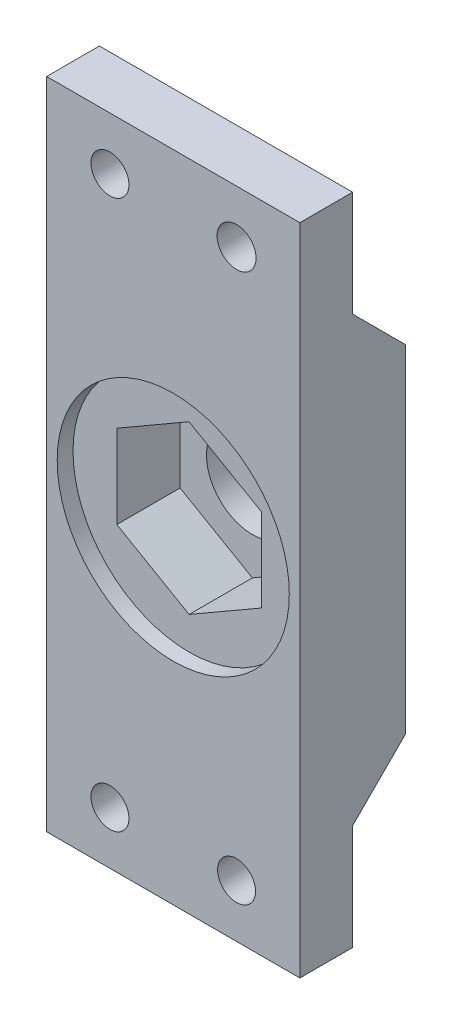
ISO-10303-21;
HEADER;
FILE_DESCRIPTION(('STEP AP214'),'2;1');
FILE_NAME('part.step','',(''),(''),'','','');
FILE_SCHEMA(('AUTOMOTIVE_DESIGN { 1 0 10303 214 1 1 1 1 }'));
ENDSEC;
DATA;
#1=APPLICATION_CONTEXT('core data for automotive mechanical design processes');
#2=APPLICATION_PROTOCOL_DEFINITION('international standard','automotive_design',2000,#1);
#3=PRODUCT_CONTEXT('',#1,'mechanical');
#4=PRODUCT('Part','Part','',(#3));
#5=PRODUCT_RELATED_PRODUCT_CATEGORY('part','',(#4));
#6=PRODUCT_DEFINITION_FORMATION('','',#4);
#7=PRODUCT_DEFINITION_CONTEXT('part definition',#1,'design');
#8=PRODUCT_DEFINITION('design','',#6,#7);
#9=PRODUCT_DEFINITION_SHAPE('','',#8);
#10=(LENGTH_UNIT() NAMED_UNIT(*) SI_UNIT(.MILLI.,.METRE.));
#11=(NAMED_UNIT(*) PLANE_ANGLE_UNIT() SI_UNIT($,.RADIAN.));
#12=(NAMED_UNIT(*) SI_UNIT($,.STERADIAN.) SOLID_ANGLE_UNIT());
#13=UNCERTAINTY_MEASURE_WITH_UNIT(LENGTH_MEASURE(1.E-05),#10,'distance_accuracy_value','');
#14=(GEOMETRIC_REPRESENTATION_CONTEXT(3) GLOBAL_UNCERTAINTY_ASSIGNED_CONTEXT((#13)) GLOBAL_UNIT_ASSIGNED_CONTEXT((#10,
#11,#12)) REPRESENTATION_CONTEXT('',''));
#15=CARTESIAN_POINT('',(0.,0.,0.));
#16=DIRECTION('',(0.,0.,1.));
#17=DIRECTION('',(1.,0.,0.));
#18=AXIS2_PLACEMENT_3D('',#15,#16,#17);
#19=CARTESIAN_POINT('',(12.,31.,10.));
#20=DIRECTION('',(-1.,0.,0.));
#21=DIRECTION('',(0.,-1.,0.));
#22=AXIS2_PLACEMENT_3D('',#19,#20,#21);
#23=PLANE('',#22);
#24=DIRECTION('',(0.,-0.999999895939708,-0.000456202337182122));
#25=VECTOR('',#24,1.);
#26=CARTESIAN_POINT('',(12.,-21.,5.00456202384655));
#27=LINE('',#26,#25);
#28=CARTESIAN_POINT('',(12.,-21.,5.00456202384655));
#29=VERTEX_POINT('',#28);
#30=CARTESIAN_POINT('',(12.,-31.,5.));
#31=VERTEX_POINT('',#30);
#32=EDGE_CURVE('E147',#29,#31,#27,.T.);
#33=ORIENTED_EDGE('',*,*,#32,.F.);
#34=DIRECTION('',(0.,-0.707106781186544,0.707106781186551));
#35=VECTOR('',#34,1.);
#36=CARTESIAN_POINT('',(12.,-21.,5.00456202384655));
#37=LINE('',#36,#35);
#38=CARTESIAN_POINT('',(12.,-15.9954379761535,0.));
#39=VERTEX_POINT('',#38);
#40=EDGE_CURVE('E337',#39,#29,#37,.T.);
#41=ORIENTED_EDGE('',*,*,#40,.F.);
#42=DIRECTION('',(0.,1.,0.));
#43=VECTOR('',#42,1.);
#44=CARTESIAN_POINT('',(12.,31.,0.));
#45=LINE('',#44,#43);
#46=CARTESIAN_POINT('',(12.,15.9954379761535,0.));
#47=VERTEX_POINT('',#46);
#48=EDGE_CURVE('E173',#39,#47,#45,.T.);
#49=ORIENTED_EDGE('',*,*,#48,.T.);
#50=DIRECTION('',(0.,-0.707106781186543,-0.707106781186552));
#51=VECTOR('',#50,1.);
#52=CARTESIAN_POINT('',(12.,21.,5.00456202384658));
#53=LINE('',#52,#51);
#54=CARTESIAN_POINT('',(12.,21.,5.00456202384658));
#55=VERTEX_POINT('',#54);
#56=EDGE_CURVE('E58',#55,#47,#53,.T.);
#57=ORIENTED_EDGE('',*,*,#56,.F.);
#58=DIRECTION('',(0.,-0.999999895939708,0.000456202337180734));
#59=VECTOR('',#58,1.);
#60=CARTESIAN_POINT('',(12.,21.,5.00456202384658));
#61=LINE('',#60,#59);
#62=CARTESIAN_POINT('',(12.,31.,5.00000000000004));
#63=VERTEX_POINT('',#62);
#64=EDGE_CURVE('E140',#63,#55,#61,.T.);
#65=ORIENTED_EDGE('',*,*,#64,.F.);
#66=DIRECTION('',(0.,0.,-1.));
#67=VECTOR('',#66,1.);
#68=CARTESIAN_POINT('',(12.,31.,10.));
#69=LINE('',#68,#67);
#70=CARTESIAN_POINT('',(12.,31.,10.));
#71=VERTEX_POINT('',#70);
#72=EDGE_CURVE('E12',#71,#63,#69,.T.);
#73=ORIENTED_EDGE('',*,*,#72,.F.);
#74=DIRECTION('',(0.,1.,0.));
#75=VECTOR('',#74,1.);
#76=CARTESIAN_POINT('',(12.,31.,10.));
#77=LINE('',#76,#75);
#78=CARTESIAN_POINT('',(12.,-31.,10.));
#79=VERTEX_POINT('',#78);
#80=EDGE_CURVE('E162',#79,#71,#77,.T.);
#81=ORIENTED_EDGE('',*,*,#80,.F.);
#82=DIRECTION('',(0.,0.,-1.));
#83=VECTOR('',#82,1.);
#84=CARTESIAN_POINT('',(12.,-31.,10.));
#85=LINE('',#84,#83);
#86=EDGE_CURVE('E181',#79,#31,#85,.T.);
#87=ORIENTED_EDGE('',*,*,#86,.T.);
#88=EDGE_LOOP('',(#33,#41,#49,#57,#65,#73,#81,#87));
#89=FACE_BOUND('',#88,.T.);
#90=ADVANCED_FACE('F34',(#89),#23,.F.);
#91=CARTESIAN_POINT('',(-12.,31.,10.));
#92=DIRECTION('',(0.,-1.,0.));
#93=DIRECTION('',(1.,0.,0.));
#94=AXIS2_PLACEMENT_3D('',#91,#92,#93);
#95=PLANE('',#94);
#96=DIRECTION('',(-1.,0.,0.));
#97=VECTOR('',#96,1.);
#98=CARTESIAN_POINT('',(12.,31.,5.00000000000004));
#99=LINE('',#98,#97);
#100=CARTESIAN_POINT('',(-12.,31.,5.00000000000004));
#101=VERTEX_POINT('',#100);
#102=EDGE_CURVE('E136',#63,#101,#99,.T.);
#103=ORIENTED_EDGE('',*,*,#102,.T.);
#104=DIRECTION('',(0.,0.,-1.));
#105=VECTOR('',#104,1.);
#106=CARTESIAN_POINT('',(-12.,31.,10.));
#107=LINE('',#106,#105);
#108=CARTESIAN_POINT('',(-12.,31.,10.));
#109=VERTEX_POINT('',#108);
#110=EDGE_CURVE('E42',#109,#101,#107,.T.);
#111=ORIENTED_EDGE('',*,*,#110,.F.);
#112=DIRECTION('',(-1.,0.,0.));
#113=VECTOR('',#112,1.);
#114=CARTESIAN_POINT('',(-12.,31.,10.));
#115=LINE('',#114,#113);
#116=EDGE_CURVE('E157',#71,#109,#115,.T.);
#117=ORIENTED_EDGE('',*,*,#116,.F.);
#118=ORIENTED_EDGE('',*,*,#72,.T.);
#119=EDGE_LOOP('',(#103,#111,#117,#118));
#120=FACE_BOUND('',#119,.T.);
#121=ADVANCED_FACE('F156',(#120),#95,.F.);
#122=CARTESIAN_POINT('',(-12.,31.,10.));
#123=DIRECTION('',(1.,0.,0.));
#124=DIRECTION('',(0.,1.,0.));
#125=AXIS2_PLACEMENT_3D('',#122,#123,#124);
#126=PLANE('',#125);
#127=DIRECTION('',(0.,-0.999999895939708,-0.000456202337182122));
#128=VECTOR('',#127,1.);
#129=CARTESIAN_POINT('',(-12.,-21.,5.00456202384655));
#130=LINE('',#129,#128);
#131=CARTESIAN_POINT('',(-12.,-21.,5.00456202384655));
#132=VERTEX_POINT('',#131);
#133=CARTESIAN_POINT('',(-12.,-31.,5.));
#134=VERTEX_POINT('',#133);
#135=EDGE_CURVE('E154',#132,#134,#130,.T.);
#136=ORIENTED_EDGE('',*,*,#135,.T.);
#137=DIRECTION('',(0.,0.,-1.));
#138=VECTOR('',#137,1.);
#139=CARTESIAN_POINT('',(-12.,-31.,10.));
#140=LINE('',#139,#138);
#141=CARTESIAN_POINT('',(-12.,-31.,10.));
#142=VERTEX_POINT('',#141);
#143=EDGE_CURVE('E185',#142,#134,#140,.T.);
#144=ORIENTED_EDGE('',*,*,#143,.F.);
#145=DIRECTION('',(0.,-1.,0.));
#146=VECTOR('',#145,1.);
#147=CARTESIAN_POINT('',(-12.,31.,10.));
#148=LINE('',#147,#146);
#149=EDGE_CURVE('E161',#109,#142,#148,.T.);
#150=ORIENTED_EDGE('',*,*,#149,.F.);
#151=ORIENTED_EDGE('',*,*,#110,.T.);
#152=DIRECTION('',(0.,-0.999999895939708,0.000456202337180734));
#153=VECTOR('',#152,1.);
#154=CARTESIAN_POINT('',(-12.,21.,5.00456202384658));
#155=LINE('',#154,#153);
#156=CARTESIAN_POINT('',(-12.,21.,5.00456202384658));
#157=VERTEX_POINT('',#156);
#158=EDGE_CURVE('E142',#101,#157,#155,.T.);
#159=ORIENTED_EDGE('',*,*,#158,.T.);
#160=DIRECTION('',(0.,-0.707106781186543,-0.707106781186552));
#161=VECTOR('',#160,1.);
#162=CARTESIAN_POINT('',(-12.,21.,5.00456202384658));
#163=LINE('',#162,#161);
#164=CARTESIAN_POINT('',(-12.,15.9954379761535,0.));
#165=VERTEX_POINT('',#164);
#166=EDGE_CURVE('E332',#157,#165,#163,.T.);
#167=ORIENTED_EDGE('',*,*,#166,.T.);
#168=DIRECTION('',(0.,-1.,0.));
#169=VECTOR('',#168,1.);
#170=CARTESIAN_POINT('',(-12.,31.,0.));
#171=LINE('',#170,#169);
#172=CARTESIAN_POINT('',(-12.,-15.9954379761535,0.));
#173=VERTEX_POINT('',#172);
#174=EDGE_CURVE('E170',#165,#173,#171,.T.);
#175=ORIENTED_EDGE('',*,*,#174,.T.);
#176=DIRECTION('',(0.,-0.707106781186544,0.707106781186551));
#177=VECTOR('',#176,1.);
#178=CARTESIAN_POINT('',(-12.,-21.,5.00456202384655));
#179=LINE('',#178,#177);
#180=EDGE_CURVE('E50',#173,#132,#179,.T.);
#181=ORIENTED_EDGE('',*,*,#180,.T.);
#182=EDGE_LOOP('',(#136,#144,#150,#151,#159,#167,#175,#181));
#183=FACE_BOUND('',#182,.T.);
#184=ADVANCED_FACE('F303',(#183),#126,.F.);
#185=CARTESIAN_POINT('',(-12.,-31.,10.));
#186=DIRECTION('',(0.,1.,0.));
#187=DIRECTION('',(0.,0.,1.));
#188=AXIS2_PLACEMENT_3D('',#185,#186,#187);
#189=PLANE('',#188);
#190=DIRECTION('',(-1.,0.,0.));
#191=VECTOR('',#190,1.);
#192=CARTESIAN_POINT('',(12.,-31.,5.));
#193=LINE('',#192,#191);
#194=EDGE_CURVE('E196',#31,#134,#193,.T.);
#195=ORIENTED_EDGE('',*,*,#194,.F.);
#196=ORIENTED_EDGE('',*,*,#86,.F.);
#197=DIRECTION('',(1.,0.,0.));
#198=VECTOR('',#197,1.);
#199=CARTESIAN_POINT('',(-12.,-31.,10.));
#200=LINE('',#199,#198);
#201=EDGE_CURVE('E167',#142,#79,#200,.T.);
#202=ORIENTED_EDGE('',*,*,#201,.F.);
#203=ORIENTED_EDGE('',*,*,#143,.T.);
#204=EDGE_LOOP('',(#195,#196,#202,#203));
#205=FACE_BOUND('',#204,.T.);
#206=ADVANCED_FACE('F307',(#205),#189,.F.);
#207=CARTESIAN_POINT('',(0.,0.,0.));
#208=DIRECTION('',(0.,0.,1.));
#209=DIRECTION('',(1.,0.,0.));
#210=AXIS2_PLACEMENT_3D('',#207,#208,#209);
#211=PLANE('',#210);
#212=CARTESIAN_POINT('',(0.,0.,0.));
#213=DIRECTION('',(0.,0.,1.));
#214=DIRECTION('',(1.,0.,0.));
#215=AXIS2_PLACEMENT_3D('',#212,#213,#214);
#216=CIRCLE('',#215,4.35);
#217=CARTESIAN_POINT('',(4.35,0.,0.));
#218=VERTEX_POINT('',#217);
#219=EDGE_CURVE('E192',#218,#218,#216,.T.);
#220=ORIENTED_EDGE('',*,*,#219,.T.);
#221=EDGE_LOOP('',(#220));
#222=FACE_BOUND('',#221,.T.);
#223=DIRECTION('',(-1.,0.,0.));
#224=VECTOR('',#223,1.);
#225=CARTESIAN_POINT('',(12.,-15.9954379761535,0.));
#226=LINE('',#225,#224);
#227=EDGE_CURVE('E207',#39,#173,#226,.T.);
#228=ORIENTED_EDGE('',*,*,#227,.T.);
#229=ORIENTED_EDGE('',*,*,#174,.F.);
#230=DIRECTION('',(-1.,0.,0.));
#231=VECTOR('',#230,1.);
#232=CARTESIAN_POINT('',(12.,15.9954379761535,0.));
#233=LINE('',#232,#231);
#234=EDGE_CURVE('E213',#47,#165,#233,.T.);
#235=ORIENTED_EDGE('',*,*,#234,.F.);
#236=ORIENTED_EDGE('',*,*,#48,.F.);
#237=EDGE_LOOP('',(#228,#229,#235,#236));
#238=FACE_BOUND('',#237,.T.);
#239=ADVANCED_FACE('F313',(#222,#238),#211,.F.);
#240=CARTESIAN_POINT('',(6.,26.,0.));
#241=DIRECTION('',(0.,0.,1.));
#242=DIRECTION('',(1.,0.,0.));
#243=AXIS2_PLACEMENT_3D('',#240,#241,#242);
#244=CYLINDRICAL_SURFACE('',#243,1.85);
#245=CARTESIAN_POINT('',(6.,26.,10.));
#246=DIRECTION('',(0.,0.,1.));
#247=DIRECTION('',(1.,0.,0.));
#248=AXIS2_PLACEMENT_3D('',#245,#246,#247);
#249=CIRCLE('',#248,1.85);
#250=CARTESIAN_POINT('',(7.85,26.,10.));
#251=VERTEX_POINT('',#250);
#252=EDGE_CURVE('E228',#251,#251,#249,.T.);
#253=ORIENTED_EDGE('',*,*,#252,.T.);
#254=EDGE_LOOP('',(#253));
#255=FACE_BOUND('',#254,.T.);
#256=CARTESIAN_POINT('',(6.,26.,5.00228101192331));
#257=DIRECTION('',(0.,-0.000456202337180734,-0.999999895939708));
#258=DIRECTION('',(0.,-0.999999895939709,0.000456202337180734));
#259=AXIS2_PLACEMENT_3D('',#256,#257,#258);
#260=ELLIPSE('',#259,1.85000019251156,1.85);
#261=CARTESIAN_POINT('',(6.,24.15,5.00312498633492));
#262=VERTEX_POINT('',#261);
#263=EDGE_CURVE('E216',#262,#262,#260,.F.);
#264=ORIENTED_EDGE('',*,*,#263,.F.);
#265=EDGE_LOOP('',(#264));
#266=FACE_BOUND('',#265,.T.);
#267=ADVANCED_FACE('F316',(#255,#266),#244,.F.);
#268=CARTESIAN_POINT('',(-6.,26.,0.));
#269=DIRECTION('',(0.,0.,1.));
#270=DIRECTION('',(1.,0.,0.));
#271=AXIS2_PLACEMENT_3D('',#268,#269,#270);
#272=CYLINDRICAL_SURFACE('',#271,1.8);
#273=CARTESIAN_POINT('',(-6.,26.,10.));
#274=DIRECTION('',(0.,0.,1.));
#275=DIRECTION('',(1.,0.,0.));
#276=AXIS2_PLACEMENT_3D('',#273,#274,#275);
#277=CIRCLE('',#276,1.8);
#278=CARTESIAN_POINT('',(-4.2,26.,10.));
#279=VERTEX_POINT('',#278);
#280=EDGE_CURVE('E225',#279,#279,#277,.T.);
#281=ORIENTED_EDGE('',*,*,#280,.T.);
#282=EDGE_LOOP('',(#281));
#283=FACE_BOUND('',#282,.T.);
#284=CARTESIAN_POINT('',(-6.,26.,5.00228101192331));
#285=DIRECTION('',(0.,-0.000456202337180734,-0.999999895939708));
#286=DIRECTION('',(0.,-0.999999895939709,0.000456202337180734));
#287=AXIS2_PLACEMENT_3D('',#284,#285,#286);
#288=ELLIPSE('',#287,1.80000018730854,1.8);
#289=CARTESIAN_POINT('',(-6.,24.2,5.00310217621568));
#290=VERTEX_POINT('',#289);
#291=EDGE_CURVE('E37',#290,#290,#288,.F.);
#292=ORIENTED_EDGE('',*,*,#291,.F.);
#293=EDGE_LOOP('',(#292));
#294=FACE_BOUND('',#293,.T.);
#295=ADVANCED_FACE('F321',(#283,#294),#272,.F.);
#296=CARTESIAN_POINT('',(-6.,-26.,0.));
#297=DIRECTION('',(0.,0.,1.));
#298=DIRECTION('',(1.,0.,0.));
#299=AXIS2_PLACEMENT_3D('',#296,#297,#298);
#300=CYLINDRICAL_SURFACE('',#299,1.8);
#301=CARTESIAN_POINT('',(-6.,-26.,10.));
#302=DIRECTION('',(0.,0.,1.));
#303=DIRECTION('',(1.,0.,0.));
#304=AXIS2_PLACEMENT_3D('',#301,#302,#303);
#305=CIRCLE('',#304,1.8);
#306=CARTESIAN_POINT('',(-4.2,-26.,10.));
#307=VERTEX_POINT('',#306);
#308=EDGE_CURVE('E222',#307,#307,#305,.T.);
#309=ORIENTED_EDGE('',*,*,#308,.T.);
#310=EDGE_LOOP('',(#309));
#311=FACE_BOUND('',#310,.T.);
#312=CARTESIAN_POINT('',(-6.,-26.,5.00228101192327));
#313=DIRECTION('',(0.,0.000456202337182122,-0.999999895939708));
#314=DIRECTION('',(0.,0.999999895939709,0.000456202337182122));
#315=AXIS2_PLACEMENT_3D('',#312,#313,#314);
#316=ELLIPSE('',#315,1.80000018730854,1.8);
#317=CARTESIAN_POINT('',(-6.,-24.2,5.00310217621565));
#318=VERTEX_POINT('',#317);
#319=EDGE_CURVE('E195',#318,#318,#316,.F.);
#320=ORIENTED_EDGE('',*,*,#319,.F.);
#321=EDGE_LOOP('',(#320));
#322=FACE_BOUND('',#321,.T.);
#323=ADVANCED_FACE('F348',(#311,#322),#300,.F.);
#324=CARTESIAN_POINT('',(6.,-26.,0.));
#325=DIRECTION('',(0.,0.,1.));
#326=DIRECTION('',(1.,0.,0.));
#327=AXIS2_PLACEMENT_3D('',#324,#325,#326);
#328=CYLINDRICAL_SURFACE('',#327,1.8);
#329=CARTESIAN_POINT('',(6.,-26.,10.));
#330=DIRECTION('',(0.,0.,1.));
#331=DIRECTION('',(1.,0.,0.));
#332=AXIS2_PLACEMENT_3D('',#329,#330,#331);
#333=CIRCLE('',#332,1.8);
#334=CARTESIAN_POINT('',(7.8,-26.,10.));
#335=VERTEX_POINT('',#334);
#336=EDGE_CURVE('E219',#335,#335,#333,.T.);
#337=ORIENTED_EDGE('',*,*,#336,.T.);
#338=EDGE_LOOP('',(#337));
#339=FACE_BOUND('',#338,.T.);
#340=CARTESIAN_POINT('',(6.,-26.,5.00228101192327));
#341=DIRECTION('',(0.,0.000456202337182122,-0.999999895939708));
#342=DIRECTION('',(0.,0.999999895939709,0.000456202337182122));
#343=AXIS2_PLACEMENT_3D('',#340,#341,#342);
#344=ELLIPSE('',#343,1.80000018730854,1.8);
#345=CARTESIAN_POINT('',(6.,-24.2,5.00310217621565));
#346=VERTEX_POINT('',#345);
#347=EDGE_CURVE('E193',#346,#346,#344,.F.);
#348=ORIENTED_EDGE('',*,*,#347,.F.);
#349=EDGE_LOOP('',(#348));
#350=FACE_BOUND('',#349,.T.);
#351=ADVANCED_FACE('F296',(#339,#350),#328,.F.);
#352=CARTESIAN_POINT('',(0.,0.,10.));
#353=DIRECTION('',(0.,0.,1.));
#354=DIRECTION('',(1.,0.,0.));
#355=AXIS2_PLACEMENT_3D('',#352,#353,#354);
#356=PLANE('',#355);
#357=ORIENTED_EDGE('',*,*,#336,.F.);
#358=EDGE_LOOP('',(#357));
#359=FACE_BOUND('',#358,.T.);
#360=ORIENTED_EDGE('',*,*,#308,.F.);
#361=EDGE_LOOP('',(#360));
#362=FACE_BOUND('',#361,.T.);
#363=ORIENTED_EDGE('',*,*,#280,.F.);
#364=EDGE_LOOP('',(#363));
#365=FACE_BOUND('',#364,.T.);
#366=ORIENTED_EDGE('',*,*,#252,.F.);
#367=EDGE_LOOP('',(#366));
#368=FACE_BOUND('',#367,.T.);
#369=ORIENTED_EDGE('',*,*,#80,.T.);
#370=ORIENTED_EDGE('',*,*,#116,.T.);
#371=ORIENTED_EDGE('',*,*,#149,.T.);
#372=ORIENTED_EDGE('',*,*,#201,.T.);
#373=EDGE_LOOP('',(#369,#370,#371,#372));
#374=FACE_BOUND('',#373,.T.);
#375=CARTESIAN_POINT('',(0.,0.,10.));
#376=DIRECTION('',(0.,0.,-1.));
#377=DIRECTION('',(-1.,0.,0.));
#378=AXIS2_PLACEMENT_3D('',#375,#376,#377);
#379=CIRCLE('',#378,11.);
#380=CARTESIAN_POINT('',(-11.,0.,10.));
#381=VERTEX_POINT('',#380);
#382=EDGE_CURVE('E176',#381,#381,#379,.T.);
#383=ORIENTED_EDGE('',*,*,#382,.T.);
#384=EDGE_LOOP('',(#383));
#385=FACE_BOUND('',#384,.T.);
#386=ADVANCED_FACE('F164',(#359,#362,#365,#368,#374,#385),#356,.T.);
#387=CARTESIAN_POINT('',(0.,0.,8.5));
#388=DIRECTION('',(0.,0.,1.));
#389=DIRECTION('',(1.,0.,0.));
#390=AXIS2_PLACEMENT_3D('',#387,#388,#389);
#391=CYLINDRICAL_SURFACE('',#390,11.);
#392=CARTESIAN_POINT('',(0.,0.,8.5));
#393=DIRECTION('',(0.,0.,-1.));
#394=DIRECTION('',(-1.,0.,0.));
#395=AXIS2_PLACEMENT_3D('',#392,#393,#394);
#396=CIRCLE('',#395,11.);
#397=CARTESIAN_POINT('',(-11.,0.,8.5));
#398=VERTEX_POINT('',#397);
#399=EDGE_CURVE('E182',#398,#398,#396,.T.);
#400=ORIENTED_EDGE('',*,*,#399,.T.);
#401=EDGE_LOOP('',(#400));
#402=FACE_BOUND('',#401,.T.);
#403=ORIENTED_EDGE('',*,*,#382,.F.);
#404=EDGE_LOOP('',(#403));
#405=FACE_BOUND('',#404,.T.);
#406=ADVANCED_FACE('F285',(#402,#405),#391,.F.);
#407=CARTESIAN_POINT('',(0.,0.,8.5));
#408=DIRECTION('',(0.,0.,-1.));
#409=DIRECTION('',(-1.,0.,0.));
#410=AXIS2_PLACEMENT_3D('',#407,#408,#409);
#411=PLANE('',#410);
#412=DIRECTION('',(0.866025403784438,0.5,0.));
#413=VECTOR('',#412,1.);
#414=CARTESIAN_POINT('',(0.,-7.90969868789788,8.5));
#415=LINE('',#414,#413);
#416=CARTESIAN_POINT('',(0.,-7.90969868789788,8.5));
#417=VERTEX_POINT('',#416);
#418=CARTESIAN_POINT('',(6.85,-3.95484934394893,8.5));
#419=VERTEX_POINT('',#418);
#420=EDGE_CURVE('E254',#417,#419,#415,.T.);
#421=ORIENTED_EDGE('',*,*,#420,.F.);
#422=DIRECTION('',(0.866025403784439,-0.5,0.));
#423=VECTOR('',#422,1.);
#424=CARTESIAN_POINT('',(-6.85,-3.95484934394894,8.5));
#425=LINE('',#424,#423);
#426=CARTESIAN_POINT('',(-6.85,-3.95484934394894,8.5));
#427=VERTEX_POINT('',#426);
#428=EDGE_CURVE('E191',#427,#417,#425,.T.);
#429=ORIENTED_EDGE('',*,*,#428,.F.);
#430=DIRECTION('',(0.,-1.,0.));
#431=VECTOR('',#430,1.);
#432=CARTESIAN_POINT('',(-6.85,3.95484934394894,8.5));
#433=LINE('',#432,#431);
#434=CARTESIAN_POINT('',(-6.85,3.95484934394894,8.5));
#435=VERTEX_POINT('',#434);
#436=EDGE_CURVE('E237',#435,#427,#433,.T.);
#437=ORIENTED_EDGE('',*,*,#436,.F.);
#438=DIRECTION('',(-0.866025403784438,-0.5,0.));
#439=VECTOR('',#438,1.);
#440=CARTESIAN_POINT('',(0.,7.90969868789788,8.5));
#441=LINE('',#440,#439);
#442=CARTESIAN_POINT('',(0.,7.90969868789788,8.5));
#443=VERTEX_POINT('',#442);
#444=EDGE_CURVE('E263',#443,#435,#441,.T.);
#445=ORIENTED_EDGE('',*,*,#444,.F.);
#446=DIRECTION('',(-0.866025403784439,0.5,0.));
#447=VECTOR('',#446,1.);
#448=CARTESIAN_POINT('',(6.85,3.95484934394894,8.5));
#449=LINE('',#448,#447);
#450=CARTESIAN_POINT('',(6.85,3.95484934394894,8.5));
#451=VERTEX_POINT('',#450);
#452=EDGE_CURVE('E260',#451,#443,#449,.T.);
#453=ORIENTED_EDGE('',*,*,#452,.F.);
#454=DIRECTION('',(0.,1.,0.));
#455=VECTOR('',#454,1.);
#456=CARTESIAN_POINT('',(6.85,-3.95484934394893,8.5));
#457=LINE('',#456,#455);
#458=EDGE_CURVE('E257',#419,#451,#457,.T.);
#459=ORIENTED_EDGE('',*,*,#458,.F.);
#460=EDGE_LOOP('',(#421,#429,#437,#445,#453,#459));
#461=FACE_BOUND('',#460,.T.);
#462=ORIENTED_EDGE('',*,*,#399,.F.);
#463=EDGE_LOOP('',(#462));
#464=FACE_BOUND('',#463,.T.);
#465=ADVANCED_FACE('F287',(#461,#464),#411,.F.);
#466=CARTESIAN_POINT('',(-6.85,-3.95484934394894,2.5));
#467=DIRECTION('',(-0.5,-0.866025403784439,0.));
#468=DIRECTION('',(0.866025403784439,-0.5,0.));
#469=AXIS2_PLACEMENT_3D('',#466,#467,#468);
#470=PLANE('',#469);
#471=ORIENTED_EDGE('',*,*,#428,.T.);
#472=DIRECTION('',(0.,0.,1.));
#473=VECTOR('',#472,1.);
#474=CARTESIAN_POINT('',(0.,-7.90969868789788,2.5));
#475=LINE('',#474,#473);
#476=CARTESIAN_POINT('',(0.,-7.90969868789788,2.5));
#477=VERTEX_POINT('',#476);
#478=EDGE_CURVE('E252',#477,#417,#475,.T.);
#479=ORIENTED_EDGE('',*,*,#478,.F.);
#480=DIRECTION('',(0.866025403784439,-0.5,0.));
#481=VECTOR('',#480,1.);
#482=CARTESIAN_POINT('',(-6.85,-3.95484934394894,2.5));
#483=LINE('',#482,#481);
#484=CARTESIAN_POINT('',(-6.85,-3.95484934394894,2.5));
#485=VERTEX_POINT('',#484);
#486=EDGE_CURVE('E233',#485,#477,#483,.T.);
#487=ORIENTED_EDGE('',*,*,#486,.F.);
#488=DIRECTION('',(0.,0.,1.));
#489=VECTOR('',#488,1.);
#490=CARTESIAN_POINT('',(-6.85,-3.95484934394894,2.5));
#491=LINE('',#490,#489);
#492=EDGE_CURVE('E268',#485,#427,#491,.T.);
#493=ORIENTED_EDGE('',*,*,#492,.T.);
#494=EDGE_LOOP('',(#471,#479,#487,#493));
#495=FACE_BOUND('',#494,.T.);
#496=ADVANCED_FACE('F293',(#495),#470,.F.);
#497=CARTESIAN_POINT('',(-6.85,3.95484934394894,2.5));
#498=DIRECTION('',(-1.,0.,0.));
#499=DIRECTION('',(0.,0.,1.));
#500=AXIS2_PLACEMENT_3D('',#497,#498,#499);
#501=PLANE('',#500);
#502=ORIENTED_EDGE('',*,*,#436,.T.);
#503=ORIENTED_EDGE('',*,*,#492,.F.);
#504=DIRECTION('',(0.,-1.,0.));
#505=VECTOR('',#504,1.);
#506=CARTESIAN_POINT('',(-6.85,3.95484934394894,2.5));
#507=LINE('',#506,#505);
#508=CARTESIAN_POINT('',(-6.85,3.95484934394894,2.5));
#509=VERTEX_POINT('',#508);
#510=EDGE_CURVE('E249',#509,#485,#507,.T.);
#511=ORIENTED_EDGE('',*,*,#510,.F.);
#512=DIRECTION('',(0.,0.,1.));
#513=VECTOR('',#512,1.);
#514=CARTESIAN_POINT('',(-6.85,3.95484934394894,2.5));
#515=LINE('',#514,#513);
#516=EDGE_CURVE('E270',#509,#435,#515,.T.);
#517=ORIENTED_EDGE('',*,*,#516,.T.);
#518=EDGE_LOOP('',(#502,#503,#511,#517));
#519=FACE_BOUND('',#518,.T.);
#520=ADVANCED_FACE('F370',(#519),#501,.F.);
#521=CARTESIAN_POINT('',(0.,7.90969868789788,2.5));
#522=DIRECTION('',(-0.5,0.866025403784439,0.));
#523=DIRECTION('',(-0.866025403784439,-0.5,0.));
#524=AXIS2_PLACEMENT_3D('',#521,#522,#523);
#525=PLANE('',#524);
#526=ORIENTED_EDGE('',*,*,#444,.T.);
#527=ORIENTED_EDGE('',*,*,#516,.F.);
#528=DIRECTION('',(-0.866025403784438,-0.5,0.));
#529=VECTOR('',#528,1.);
#530=CARTESIAN_POINT('',(0.,7.90969868789788,2.5));
#531=LINE('',#530,#529);
#532=CARTESIAN_POINT('',(0.,7.90969868789788,2.5));
#533=VERTEX_POINT('',#532);
#534=EDGE_CURVE('E246',#533,#509,#531,.T.);
#535=ORIENTED_EDGE('',*,*,#534,.F.);
#536=DIRECTION('',(0.,0.,1.));
#537=VECTOR('',#536,1.);
#538=CARTESIAN_POINT('',(0.,7.90969868789788,2.5));
#539=LINE('',#538,#537);
#540=EDGE_CURVE('E272',#533,#443,#539,.T.);
#541=ORIENTED_EDGE('',*,*,#540,.T.);
#542=EDGE_LOOP('',(#526,#527,#535,#541));
#543=FACE_BOUND('',#542,.T.);
#544=ADVANCED_FACE('F373',(#543),#525,.F.);
#545=CARTESIAN_POINT('',(6.85,3.95484934394894,2.5));
#546=DIRECTION('',(0.5,0.866025403784439,0.));
#547=DIRECTION('',(-0.866025403784439,0.5,0.));
#548=AXIS2_PLACEMENT_3D('',#545,#546,#547);
#549=PLANE('',#548);
#550=ORIENTED_EDGE('',*,*,#452,.T.);
#551=ORIENTED_EDGE('',*,*,#540,.F.);
#552=DIRECTION('',(-0.866025403784439,0.5,0.));
#553=VECTOR('',#552,1.);
#554=CARTESIAN_POINT('',(6.85,3.95484934394894,2.5));
#555=LINE('',#554,#553);
#556=CARTESIAN_POINT('',(6.85,3.95484934394894,2.5));
#557=VERTEX_POINT('',#556);
#558=EDGE_CURVE('E243',#557,#533,#555,.T.);
#559=ORIENTED_EDGE('',*,*,#558,.F.);
#560=DIRECTION('',(0.,0.,1.));
#561=VECTOR('',#560,1.);
#562=CARTESIAN_POINT('',(6.85,3.95484934394894,2.5));
#563=LINE('',#562,#561);
#564=EDGE_CURVE('E274',#557,#451,#563,.T.);
#565=ORIENTED_EDGE('',*,*,#564,.T.);
#566=EDGE_LOOP('',(#550,#551,#559,#565));
#567=FACE_BOUND('',#566,.T.);
#568=ADVANCED_FACE('F377',(#567),#549,.F.);
#569=CARTESIAN_POINT('',(6.85,-3.95484934394893,2.5));
#570=DIRECTION('',(1.,0.,0.));
#571=DIRECTION('',(0.,0.,-1.));
#572=AXIS2_PLACEMENT_3D('',#569,#570,#571);
#573=PLANE('',#572);
#574=ORIENTED_EDGE('',*,*,#458,.T.);
#575=ORIENTED_EDGE('',*,*,#564,.F.);
#576=DIRECTION('',(0.,1.,0.));
#577=VECTOR('',#576,1.);
#578=CARTESIAN_POINT('',(6.85,-3.95484934394893,2.5));
#579=LINE('',#578,#577);
#580=CARTESIAN_POINT('',(6.85,-3.95484934394893,2.5));
#581=VERTEX_POINT('',#580);
#582=EDGE_CURVE('E240',#581,#557,#579,.T.);
#583=ORIENTED_EDGE('',*,*,#582,.F.);
#584=DIRECTION('',(0.,0.,1.));
#585=VECTOR('',#584,1.);
#586=CARTESIAN_POINT('',(6.85,-3.95484934394893,2.5));
#587=LINE('',#586,#585);
#588=EDGE_CURVE('E276',#581,#419,#587,.T.);
#589=ORIENTED_EDGE('',*,*,#588,.T.);
#590=EDGE_LOOP('',(#574,#575,#583,#589));
#591=FACE_BOUND('',#590,.T.);
#592=ADVANCED_FACE('F381',(#591),#573,.F.);
#593=CARTESIAN_POINT('',(0.,-7.90969868789788,2.5));
#594=DIRECTION('',(0.5,-0.866025403784438,0.));
#595=DIRECTION('',(0.866025403784439,0.5,0.));
#596=AXIS2_PLACEMENT_3D('',#593,#594,#595);
#597=PLANE('',#596);
#598=ORIENTED_EDGE('',*,*,#420,.T.);
#599=ORIENTED_EDGE('',*,*,#588,.F.);
#600=DIRECTION('',(0.866025403784438,0.5,0.));
#601=VECTOR('',#600,1.);
#602=CARTESIAN_POINT('',(0.,-7.90969868789788,2.5));
#603=LINE('',#602,#601);
#604=EDGE_CURVE('E236',#477,#581,#603,.T.);
#605=ORIENTED_EDGE('',*,*,#604,.F.);
#606=ORIENTED_EDGE('',*,*,#478,.T.);
#607=EDGE_LOOP('',(#598,#599,#605,#606));
#608=FACE_BOUND('',#607,.T.);
#609=ADVANCED_FACE('F368',(#608),#597,.F.);
#610=CARTESIAN_POINT('',(0.,0.,2.5));
#611=DIRECTION('',(0.,0.,1.));
#612=DIRECTION('',(1.,0.,0.));
#613=AXIS2_PLACEMENT_3D('',#610,#611,#612);
#614=PLANE('',#613);
#615=CARTESIAN_POINT('',(0.,0.,2.5));
#616=DIRECTION('',(0.,0.,1.));
#617=DIRECTION('',(1.,0.,0.));
#618=AXIS2_PLACEMENT_3D('',#615,#616,#617);
#619=CIRCLE('',#618,4.35);
#620=CARTESIAN_POINT('',(4.35,0.,2.5));
#621=VERTEX_POINT('',#620);
#622=EDGE_CURVE('E189',#621,#621,#619,.T.);
#623=ORIENTED_EDGE('',*,*,#622,.F.);
#624=EDGE_LOOP('',(#623));
#625=FACE_BOUND('',#624,.T.);
#626=ORIENTED_EDGE('',*,*,#486,.T.);
#627=ORIENTED_EDGE('',*,*,#604,.T.);
#628=ORIENTED_EDGE('',*,*,#582,.T.);
#629=ORIENTED_EDGE('',*,*,#558,.T.);
#630=ORIENTED_EDGE('',*,*,#534,.T.);
#631=ORIENTED_EDGE('',*,*,#510,.T.);
#632=EDGE_LOOP('',(#626,#627,#628,#629,#630,#631));
#633=FACE_BOUND('',#632,.T.);
#634=ADVANCED_FACE('F364',(#625,#633),#614,.T.);
#635=CARTESIAN_POINT('',(0.,0.,0.));
#636=DIRECTION('',(0.,0.,1.));
#637=DIRECTION('',(1.,0.,0.));
#638=AXIS2_PLACEMENT_3D('',#635,#636,#637);
#639=CYLINDRICAL_SURFACE('',#638,4.35);
#640=ORIENTED_EDGE('',*,*,#622,.T.);
#641=EDGE_LOOP('',(#640));
#642=FACE_BOUND('',#641,.T.);
#643=ORIENTED_EDGE('',*,*,#219,.F.);
#644=EDGE_LOOP('',(#643));
#645=FACE_BOUND('',#644,.T.);
#646=ADVANCED_FACE('F344',(#642,#645),#639,.F.);
#647=CARTESIAN_POINT('',(12.,-21.,5.00456202384655));
#648=DIRECTION('',(0.,0.000456202337182122,-0.999999895939708));
#649=DIRECTION('',(0.,0.999999895939709,0.000456202337182122));
#650=AXIS2_PLACEMENT_3D('',#647,#648,#649);
#651=PLANE('',#650);
#652=ORIENTED_EDGE('',*,*,#347,.T.);
#653=EDGE_LOOP('',(#652));
#654=FACE_BOUND('',#653,.T.);
#655=ORIENTED_EDGE('',*,*,#135,.F.);
#656=DIRECTION('',(-1.,0.,0.));
#657=VECTOR('',#656,1.);
#658=CARTESIAN_POINT('',(12.,-21.,5.00456202384655));
#659=LINE('',#658,#657);
#660=EDGE_CURVE('E201',#29,#132,#659,.T.);
#661=ORIENTED_EDGE('',*,*,#660,.F.);
#662=ORIENTED_EDGE('',*,*,#32,.T.);
#663=ORIENTED_EDGE('',*,*,#194,.T.);
#664=EDGE_LOOP('',(#655,#661,#662,#663));
#665=FACE_BOUND('',#664,.T.);
#666=ORIENTED_EDGE('',*,*,#319,.T.);
#667=EDGE_LOOP('',(#666));
#668=FACE_BOUND('',#667,.T.);
#669=ADVANCED_FACE('F340',(#654,#665,#668),#651,.T.);
#670=CARTESIAN_POINT('',(12.,-21.,5.00456202384655));
#671=DIRECTION('',(0.,-0.707106781186551,-0.707106781186544));
#672=DIRECTION('',(0.,0.707106781186544,-0.707106781186551));
#673=AXIS2_PLACEMENT_3D('',#670,#671,#672);
#674=PLANE('',#673);
#675=ORIENTED_EDGE('',*,*,#180,.F.);
#676=ORIENTED_EDGE('',*,*,#227,.F.);
#677=ORIENTED_EDGE('',*,*,#40,.T.);
#678=ORIENTED_EDGE('',*,*,#660,.T.);
#679=EDGE_LOOP('',(#675,#676,#677,#678));
#680=FACE_BOUND('',#679,.T.);
#681=ADVANCED_FACE('F339',(#680),#674,.T.);
#682=CARTESIAN_POINT('',(12.,21.,5.00456202384658));
#683=DIRECTION('',(0.,-0.000456202337180734,-0.999999895939708));
#684=DIRECTION('',(0.,0.999999895939709,-0.000456202337180734));
#685=AXIS2_PLACEMENT_3D('',#682,#683,#684);
#686=PLANE('',#685);
#687=ORIENTED_EDGE('',*,*,#291,.T.);
#688=EDGE_LOOP('',(#687));
#689=FACE_BOUND('',#688,.T.);
#690=ORIENTED_EDGE('',*,*,#158,.F.);
#691=ORIENTED_EDGE('',*,*,#102,.F.);
#692=ORIENTED_EDGE('',*,*,#64,.T.);
#693=DIRECTION('',(-1.,0.,0.));
#694=VECTOR('',#693,1.);
#695=CARTESIAN_POINT('',(12.,21.,5.00456202384658));
#696=LINE('',#695,#694);
#697=EDGE_CURVE('E146',#55,#157,#696,.T.);
#698=ORIENTED_EDGE('',*,*,#697,.T.);
#699=EDGE_LOOP('',(#690,#691,#692,#698));
#700=FACE_BOUND('',#699,.T.);
#701=ORIENTED_EDGE('',*,*,#263,.T.);
#702=EDGE_LOOP('',(#701));
#703=FACE_BOUND('',#702,.T.);
#704=ADVANCED_FACE('F138',(#689,#700,#703),#686,.T.);
#705=CARTESIAN_POINT('',(12.,21.,5.00456202384658));
#706=DIRECTION('',(0.,0.707106781186552,-0.707106781186543));
#707=DIRECTION('',(0.,0.707106781186543,0.707106781186552));
#708=AXIS2_PLACEMENT_3D('',#705,#706,#707);
#709=PLANE('',#708);
#710=ORIENTED_EDGE('',*,*,#166,.F.);
#711=ORIENTED_EDGE('',*,*,#697,.F.);
#712=ORIENTED_EDGE('',*,*,#56,.T.);
#713=ORIENTED_EDGE('',*,*,#234,.T.);
#714=EDGE_LOOP('',(#710,#711,#712,#713));
#715=FACE_BOUND('',#714,.T.);
#716=ADVANCED_FACE('F455',(#715),#709,.T.);
#717=CLOSED_SHELL('',(#90,#121,#184,#206,#239,#267,#295,#323,#351,#386,#406,#465,#496,#520,#544,
#568,#592,#609,#634,#646,#669,#681,#704,#716));
#718=MANIFOLD_SOLID_BREP('B2',#717);
#719=ADVANCED_BREP_SHAPE_REPRESENTATION('',(#18,#718),#14);
#720=SHAPE_DEFINITION_REPRESENTATION(#9,#719);
ENDSEC;
END-ISO-10303-21;
